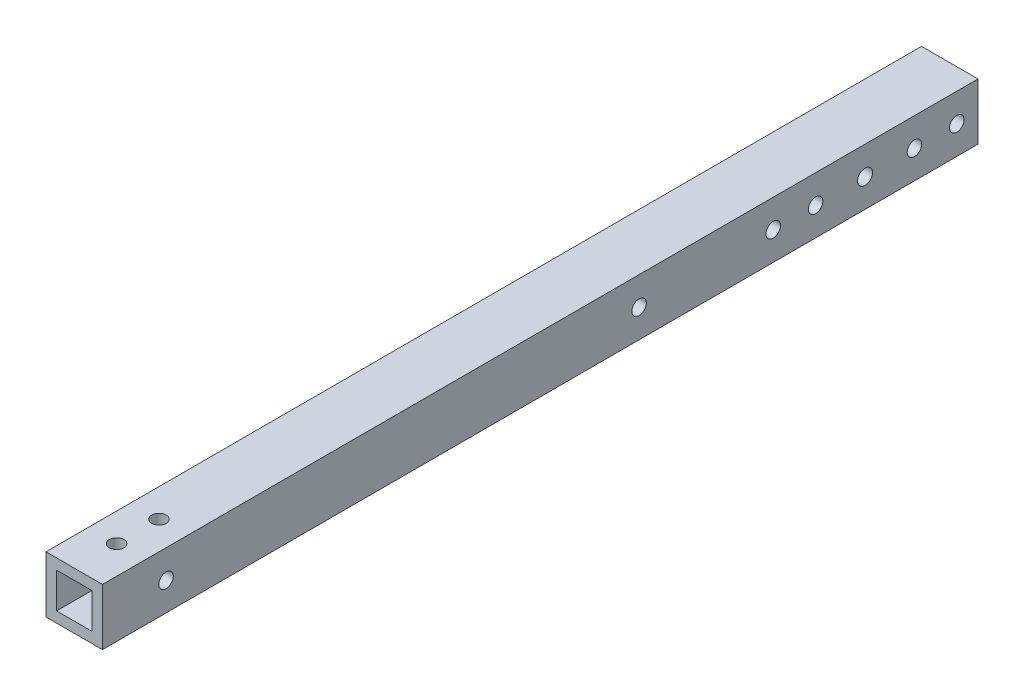
ISO-10303-21;
HEADER;
FILE_DESCRIPTION(('STEP AP214'),'2;1');
FILE_NAME('part.step','',(''),(''),'','','');
FILE_SCHEMA(('AUTOMOTIVE_DESIGN { 1 0 10303 214 1 1 1 1 }'));
ENDSEC;
DATA;
#1=APPLICATION_CONTEXT('core data for automotive mechanical design processes');
#2=APPLICATION_PROTOCOL_DEFINITION('international standard','automotive_design',2000,#1);
#3=PRODUCT_CONTEXT('',#1,'mechanical');
#4=PRODUCT('Part','Part','',(#3));
#5=PRODUCT_RELATED_PRODUCT_CATEGORY('part','',(#4));
#6=PRODUCT_DEFINITION_FORMATION('','',#4);
#7=PRODUCT_DEFINITION_CONTEXT('part definition',#1,'design');
#8=PRODUCT_DEFINITION('design','',#6,#7);
#9=PRODUCT_DEFINITION_SHAPE('','',#8);
#10=(LENGTH_UNIT() NAMED_UNIT(*) SI_UNIT(.MILLI.,.METRE.));
#11=(NAMED_UNIT(*) PLANE_ANGLE_UNIT() SI_UNIT($,.RADIAN.));
#12=(NAMED_UNIT(*) SI_UNIT($,.STERADIAN.) SOLID_ANGLE_UNIT());
#13=UNCERTAINTY_MEASURE_WITH_UNIT(LENGTH_MEASURE(1.E-05),#10,'distance_accuracy_value','');
#14=(GEOMETRIC_REPRESENTATION_CONTEXT(3) GLOBAL_UNCERTAINTY_ASSIGNED_CONTEXT((#13)) GLOBAL_UNIT_ASSIGNED_CONTEXT((#10,
#11,#12)) REPRESENTATION_CONTEXT('',''));
#15=CARTESIAN_POINT('',(0.,0.,0.));
#16=DIRECTION('',(0.,0.,1.));
#17=DIRECTION('',(1.,0.,0.));
#18=AXIS2_PLACEMENT_3D('',#15,#16,#17);
#19=CARTESIAN_POINT('',(0.,0.,196.85));
#20=DIRECTION('',(0.,0.,-1.));
#21=DIRECTION('',(-1.,0.,0.));
#22=AXIS2_PLACEMENT_3D('',#19,#20,#21);
#23=PLANE('',#22);
#24=DIRECTION('',(0.,1.,0.));
#25=VECTOR('',#24,1.);
#26=CARTESIAN_POINT('',(12.7,-12.7,196.85));
#27=LINE('',#26,#25);
#28=CARTESIAN_POINT('',(12.7,-12.7,196.85));
#29=VERTEX_POINT('',#28);
#30=CARTESIAN_POINT('',(12.7,12.7,196.85));
#31=VERTEX_POINT('',#30);
#32=EDGE_CURVE('E145',#29,#31,#27,.T.);
#33=ORIENTED_EDGE('',*,*,#32,.T.);
#34=DIRECTION('',(-1.,0.,0.));
#35=VECTOR('',#34,1.);
#36=CARTESIAN_POINT('',(-12.7,12.7,196.85));
#37=LINE('',#36,#35);
#38=CARTESIAN_POINT('',(-12.7,12.7,196.85));
#39=VERTEX_POINT('',#38);
#40=EDGE_CURVE('E148',#31,#39,#37,.T.);
#41=ORIENTED_EDGE('',*,*,#40,.T.);
#42=DIRECTION('',(0.,-1.,0.));
#43=VECTOR('',#42,1.);
#44=CARTESIAN_POINT('',(-12.7,-12.7,196.85));
#45=LINE('',#44,#43);
#46=CARTESIAN_POINT('',(-12.7,-12.7,196.85));
#47=VERTEX_POINT('',#46);
#48=EDGE_CURVE('E151',#39,#47,#45,.T.);
#49=ORIENTED_EDGE('',*,*,#48,.T.);
#50=DIRECTION('',(1.,0.,0.));
#51=VECTOR('',#50,1.);
#52=CARTESIAN_POINT('',(-12.7,-12.7,196.85));
#53=LINE('',#52,#51);
#54=EDGE_CURVE('E153',#47,#29,#53,.T.);
#55=ORIENTED_EDGE('',*,*,#54,.T.);
#56=EDGE_LOOP('',(#33,#41,#49,#55));
#57=FACE_BOUND('',#56,.T.);
#58=DIRECTION('',(0.,1.,0.));
#59=VECTOR('',#58,1.);
#60=CARTESIAN_POINT('',(7.9375,7.9375,196.85));
#61=LINE('',#60,#59);
#62=CARTESIAN_POINT('',(7.9375,-7.9375,196.85));
#63=VERTEX_POINT('',#62);
#64=CARTESIAN_POINT('',(7.9375,7.9375,196.85));
#65=VERTEX_POINT('',#64);
#66=EDGE_CURVE('E107',#63,#65,#61,.T.);
#67=ORIENTED_EDGE('',*,*,#66,.F.);
#68=DIRECTION('',(1.,0.,0.));
#69=VECTOR('',#68,1.);
#70=CARTESIAN_POINT('',(-7.9375,-7.9375,196.85));
#71=LINE('',#70,#69);
#72=CARTESIAN_POINT('',(-7.9375,-7.9375,196.85));
#73=VERTEX_POINT('',#72);
#74=EDGE_CURVE('E129',#73,#63,#71,.T.);
#75=ORIENTED_EDGE('',*,*,#74,.F.);
#76=DIRECTION('',(0.,-1.,0.));
#77=VECTOR('',#76,1.);
#78=CARTESIAN_POINT('',(-7.9375,7.9375,196.85));
#79=LINE('',#78,#77);
#80=CARTESIAN_POINT('',(-7.9375,7.9375,196.85));
#81=VERTEX_POINT('',#80);
#82=EDGE_CURVE('E127',#81,#73,#79,.T.);
#83=ORIENTED_EDGE('',*,*,#82,.F.);
#84=DIRECTION('',(-1.,0.,0.));
#85=VECTOR('',#84,1.);
#86=CARTESIAN_POINT('',(-7.9375,7.9375,196.85));
#87=LINE('',#86,#85);
#88=EDGE_CURVE('E115',#65,#81,#87,.T.);
#89=ORIENTED_EDGE('',*,*,#88,.F.);
#90=EDGE_LOOP('',(#67,#75,#83,#89));
#91=FACE_BOUND('',#90,.T.);
#92=ADVANCED_FACE('F40',(#57,#91),#23,.F.);
#93=CARTESIAN_POINT('',(0.,0.,-196.85));
#94=DIRECTION('',(0.,0.,-1.));
#95=DIRECTION('',(-1.,0.,0.));
#96=AXIS2_PLACEMENT_3D('',#93,#94,#95);
#97=PLANE('',#96);
#98=DIRECTION('',(0.,1.,0.));
#99=VECTOR('',#98,1.);
#100=CARTESIAN_POINT('',(12.7,-12.7,-196.85));
#101=LINE('',#100,#99);
#102=CARTESIAN_POINT('',(12.7,-12.7,-196.85));
#103=VERTEX_POINT('',#102);
#104=CARTESIAN_POINT('',(12.7,12.7,-196.85));
#105=VERTEX_POINT('',#104);
#106=EDGE_CURVE('E123',#103,#105,#101,.T.);
#107=ORIENTED_EDGE('',*,*,#106,.F.);
#108=DIRECTION('',(1.,0.,0.));
#109=VECTOR('',#108,1.);
#110=CARTESIAN_POINT('',(-12.7,-12.7,-196.85));
#111=LINE('',#110,#109);
#112=CARTESIAN_POINT('',(-12.7,-12.7,-196.85));
#113=VERTEX_POINT('',#112);
#114=EDGE_CURVE('E149',#113,#103,#111,.T.);
#115=ORIENTED_EDGE('',*,*,#114,.F.);
#116=DIRECTION('',(0.,-1.,0.));
#117=VECTOR('',#116,1.);
#118=CARTESIAN_POINT('',(-12.7,-12.7,-196.85));
#119=LINE('',#118,#117);
#120=CARTESIAN_POINT('',(-12.7,12.7,-196.85));
#121=VERTEX_POINT('',#120);
#122=EDGE_CURVE('E160',#121,#113,#119,.T.);
#123=ORIENTED_EDGE('',*,*,#122,.F.);
#124=DIRECTION('',(-1.,0.,0.));
#125=VECTOR('',#124,1.);
#126=CARTESIAN_POINT('',(-12.7,12.7,-196.85));
#127=LINE('',#126,#125);
#128=EDGE_CURVE('E158',#105,#121,#127,.T.);
#129=ORIENTED_EDGE('',*,*,#128,.F.);
#130=EDGE_LOOP('',(#107,#115,#123,#129));
#131=FACE_BOUND('',#130,.T.);
#132=DIRECTION('',(1.,0.,0.));
#133=VECTOR('',#132,1.);
#134=CARTESIAN_POINT('',(-7.9375,-7.9375,-196.85));
#135=LINE('',#134,#133);
#136=CARTESIAN_POINT('',(-7.9375,-7.9375,-196.85));
#137=VERTEX_POINT('',#136);
#138=CARTESIAN_POINT('',(7.9375,-7.9375,-196.85));
#139=VERTEX_POINT('',#138);
#140=EDGE_CURVE('E116',#137,#139,#135,.T.);
#141=ORIENTED_EDGE('',*,*,#140,.T.);
#142=DIRECTION('',(0.,1.,0.));
#143=VECTOR('',#142,1.);
#144=CARTESIAN_POINT('',(7.9375,7.9375,-196.85));
#145=LINE('',#144,#143);
#146=CARTESIAN_POINT('',(7.9375,7.9375,-196.85));
#147=VERTEX_POINT('',#146);
#148=EDGE_CURVE('E65',#139,#147,#145,.T.);
#149=ORIENTED_EDGE('',*,*,#148,.T.);
#150=DIRECTION('',(-1.,0.,0.));
#151=VECTOR('',#150,1.);
#152=CARTESIAN_POINT('',(-7.9375,7.9375,-196.85));
#153=LINE('',#152,#151);
#154=CARTESIAN_POINT('',(-7.9375,7.9375,-196.85));
#155=VERTEX_POINT('',#154);
#156=EDGE_CURVE('E122',#147,#155,#153,.T.);
#157=ORIENTED_EDGE('',*,*,#156,.T.);
#158=DIRECTION('',(0.,-1.,0.));
#159=VECTOR('',#158,1.);
#160=CARTESIAN_POINT('',(-7.9375,7.9375,-196.85));
#161=LINE('',#160,#159);
#162=EDGE_CURVE('E137',#155,#137,#161,.T.);
#163=ORIENTED_EDGE('',*,*,#162,.T.);
#164=EDGE_LOOP('',(#141,#149,#157,#163));
#165=FACE_BOUND('',#164,.T.);
#166=ADVANCED_FACE('F279',(#131,#165),#97,.T.);
#167=CARTESIAN_POINT('',(12.7,-12.7,196.85));
#168=DIRECTION('',(-1.,0.,0.));
#169=DIRECTION('',(0.,0.,1.));
#170=AXIS2_PLACEMENT_3D('',#167,#168,#169);
#171=PLANE('',#170);
#172=CARTESIAN_POINT('',(12.7,0.,-146.05));
#173=DIRECTION('',(-1.,0.,0.));
#174=DIRECTION('',(0.,0.,1.));
#175=AXIS2_PLACEMENT_3D('',#172,#173,#174);
#176=CIRCLE('',#175,3.373501);
#177=CARTESIAN_POINT('',(12.7,0.,-142.676499));
#178=VERTEX_POINT('',#177);
#179=EDGE_CURVE('E379',#178,#178,#176,.T.);
#180=ORIENTED_EDGE('',*,*,#179,.T.);
#181=EDGE_LOOP('',(#180));
#182=FACE_BOUND('',#181,.T.);
#183=CARTESIAN_POINT('',(12.7,0.,168.275));
#184=DIRECTION('',(-1.,0.,0.));
#185=DIRECTION('',(0.,0.,1.));
#186=AXIS2_PLACEMENT_3D('',#183,#184,#185);
#187=CIRCLE('',#186,3.2639);
#188=CARTESIAN_POINT('',(12.7,0.,171.5389));
#189=VERTEX_POINT('',#188);
#190=EDGE_CURVE('E390',#189,#189,#187,.T.);
#191=ORIENTED_EDGE('',*,*,#190,.T.);
#192=EDGE_LOOP('',(#191));
#193=FACE_BOUND('',#192,.T.);
#194=CARTESIAN_POINT('',(12.7,0.,-44.45));
#195=DIRECTION('',(-1.,0.,0.));
#196=DIRECTION('',(0.,0.,1.));
#197=AXIS2_PLACEMENT_3D('',#194,#195,#196);
#198=CIRCLE('',#197,3.2639);
#199=CARTESIAN_POINT('',(12.7,0.,-41.1861));
#200=VERTEX_POINT('',#199);
#201=EDGE_CURVE('E192',#200,#200,#198,.T.);
#202=ORIENTED_EDGE('',*,*,#201,.T.);
#203=EDGE_LOOP('',(#202));
#204=FACE_BOUND('',#203,.T.);
#205=CARTESIAN_POINT('',(12.7,0.,-104.775));
#206=DIRECTION('',(-1.,0.,0.));
#207=DIRECTION('',(0.,0.,1.));
#208=AXIS2_PLACEMENT_3D('',#205,#206,#207);
#209=CIRCLE('',#208,3.2639);
#210=CARTESIAN_POINT('',(12.7,0.,-101.5111));
#211=VERTEX_POINT('',#210);
#212=EDGE_CURVE('E179',#211,#211,#209,.T.);
#213=ORIENTED_EDGE('',*,*,#212,.T.);
#214=EDGE_LOOP('',(#213));
#215=FACE_BOUND('',#214,.T.);
#216=CARTESIAN_POINT('',(12.7,0.,-123.825));
#217=DIRECTION('',(-1.,0.,0.));
#218=DIRECTION('',(0.,0.,1.));
#219=AXIS2_PLACEMENT_3D('',#216,#217,#218);
#220=CIRCLE('',#219,3.2639);
#221=CARTESIAN_POINT('',(12.7,0.,-120.5611));
#222=VERTEX_POINT('',#221);
#223=EDGE_CURVE('E174',#222,#222,#220,.T.);
#224=ORIENTED_EDGE('',*,*,#223,.T.);
#225=EDGE_LOOP('',(#224));
#226=FACE_BOUND('',#225,.T.);
#227=CARTESIAN_POINT('',(12.7,0.,-168.275));
#228=DIRECTION('',(-1.,0.,0.));
#229=DIRECTION('',(0.,0.,1.));
#230=AXIS2_PLACEMENT_3D('',#227,#228,#229);
#231=CIRCLE('',#230,3.2639);
#232=CARTESIAN_POINT('',(12.7,0.,-165.0111));
#233=VERTEX_POINT('',#232);
#234=EDGE_CURVE('E238',#233,#233,#231,.T.);
#235=ORIENTED_EDGE('',*,*,#234,.T.);
#236=EDGE_LOOP('',(#235));
#237=FACE_BOUND('',#236,.T.);
#238=CARTESIAN_POINT('',(12.7,0.,-187.325));
#239=DIRECTION('',(-1.,0.,0.));
#240=DIRECTION('',(0.,0.,1.));
#241=AXIS2_PLACEMENT_3D('',#238,#239,#240);
#242=CIRCLE('',#241,3.2639);
#243=CARTESIAN_POINT('',(12.7,0.,-184.0611));
#244=VERTEX_POINT('',#243);
#245=EDGE_CURVE('E250',#244,#244,#242,.T.);
#246=ORIENTED_EDGE('',*,*,#245,.T.);
#247=EDGE_LOOP('',(#246));
#248=FACE_BOUND('',#247,.T.);
#249=ORIENTED_EDGE('',*,*,#106,.T.);
#250=DIRECTION('',(0.,0.,-1.));
#251=VECTOR('',#250,1.);
#252=CARTESIAN_POINT('',(12.7,12.7,196.85));
#253=LINE('',#252,#251);
#254=EDGE_CURVE('E11',#31,#105,#253,.T.);
#255=ORIENTED_EDGE('',*,*,#254,.F.);
#256=ORIENTED_EDGE('',*,*,#32,.F.);
#257=DIRECTION('',(0.,0.,-1.));
#258=VECTOR('',#257,1.);
#259=CARTESIAN_POINT('',(12.7,-12.7,196.85));
#260=LINE('',#259,#258);
#261=EDGE_CURVE('E155',#29,#103,#260,.T.);
#262=ORIENTED_EDGE('',*,*,#261,.T.);
#263=EDGE_LOOP('',(#249,#255,#256,#262));
#264=FACE_BOUND('',#263,.T.);
#265=ADVANCED_FACE('F42',(#182,#193,#204,#215,#226,#237,#248,#264),#171,.F.);
#266=CARTESIAN_POINT('',(-12.7,12.7,196.85));
#267=DIRECTION('',(0.,-1.,0.));
#268=DIRECTION('',(0.,0.,-1.));
#269=AXIS2_PLACEMENT_3D('',#266,#267,#268);
#270=PLANE('',#269);
#271=CARTESIAN_POINT('',(0.,12.7,177.8));
#272=DIRECTION('',(0.,1.,0.));
#273=DIRECTION('',(0.,0.,1.));
#274=AXIS2_PLACEMENT_3D('',#271,#272,#273);
#275=CIRCLE('',#274,3.26389999999999);
#276=CARTESIAN_POINT('',(0.,12.7,181.0639));
#277=VERTEX_POINT('',#276);
#278=EDGE_CURVE('E196',#277,#277,#275,.T.);
#279=ORIENTED_EDGE('',*,*,#278,.F.);
#280=EDGE_LOOP('',(#279));
#281=FACE_BOUND('',#280,.T.);
#282=CARTESIAN_POINT('',(0.,12.7,158.75));
#283=DIRECTION('',(0.,1.,0.));
#284=DIRECTION('',(0.,0.,1.));
#285=AXIS2_PLACEMENT_3D('',#282,#283,#284);
#286=CIRCLE('',#285,3.26389999999999);
#287=CARTESIAN_POINT('',(0.,12.7,162.0139));
#288=VERTEX_POINT('',#287);
#289=EDGE_CURVE('E214',#288,#288,#286,.T.);
#290=ORIENTED_EDGE('',*,*,#289,.F.);
#291=EDGE_LOOP('',(#290));
#292=FACE_BOUND('',#291,.T.);
#293=ORIENTED_EDGE('',*,*,#128,.T.);
#294=DIRECTION('',(0.,0.,-1.));
#295=VECTOR('',#294,1.);
#296=CARTESIAN_POINT('',(-12.7,12.7,196.85));
#297=LINE('',#296,#295);
#298=EDGE_CURVE('E49',#39,#121,#297,.T.);
#299=ORIENTED_EDGE('',*,*,#298,.F.);
#300=ORIENTED_EDGE('',*,*,#40,.F.);
#301=ORIENTED_EDGE('',*,*,#254,.T.);
#302=EDGE_LOOP('',(#293,#299,#300,#301));
#303=FACE_BOUND('',#302,.T.);
#304=ADVANCED_FACE('F288',(#281,#292,#303),#270,.F.);
#305=CARTESIAN_POINT('',(-12.7,-12.7,196.85));
#306=DIRECTION('',(1.,0.,0.));
#307=DIRECTION('',(0.,0.,-1.));
#308=AXIS2_PLACEMENT_3D('',#305,#306,#307);
#309=PLANE('',#308);
#310=CARTESIAN_POINT('',(-12.7,0.,-146.05));
#311=DIRECTION('',(-1.,0.,0.));
#312=DIRECTION('',(0.,0.,1.));
#313=AXIS2_PLACEMENT_3D('',#310,#311,#312);
#314=CIRCLE('',#313,3.373501);
#315=CARTESIAN_POINT('',(-12.7,0.,-142.676499));
#316=VERTEX_POINT('',#315);
#317=EDGE_CURVE('E378',#316,#316,#314,.T.);
#318=ORIENTED_EDGE('',*,*,#317,.F.);
#319=EDGE_LOOP('',(#318));
#320=FACE_BOUND('',#319,.T.);
#321=CARTESIAN_POINT('',(-12.7,0.,168.275));
#322=DIRECTION('',(-1.,0.,0.));
#323=DIRECTION('',(0.,0.,1.));
#324=AXIS2_PLACEMENT_3D('',#321,#322,#323);
#325=CIRCLE('',#324,3.26389999999999);
#326=CARTESIAN_POINT('',(-12.7,0.,171.5389));
#327=VERTEX_POINT('',#326);
#328=EDGE_CURVE('E387',#327,#327,#325,.T.);
#329=ORIENTED_EDGE('',*,*,#328,.F.);
#330=EDGE_LOOP('',(#329));
#331=FACE_BOUND('',#330,.T.);
#332=CARTESIAN_POINT('',(-12.7,0.,-44.45));
#333=DIRECTION('',(-1.,0.,0.));
#334=DIRECTION('',(0.,0.,1.));
#335=AXIS2_PLACEMENT_3D('',#332,#333,#334);
#336=CIRCLE('',#335,3.26389999999999);
#337=CARTESIAN_POINT('',(-12.7,0.,-41.1861));
#338=VERTEX_POINT('',#337);
#339=EDGE_CURVE('E199',#338,#338,#336,.T.);
#340=ORIENTED_EDGE('',*,*,#339,.F.);
#341=EDGE_LOOP('',(#340));
#342=FACE_BOUND('',#341,.T.);
#343=CARTESIAN_POINT('',(-12.7,0.,-104.775));
#344=DIRECTION('',(-1.,0.,0.));
#345=DIRECTION('',(0.,0.,1.));
#346=AXIS2_PLACEMENT_3D('',#343,#344,#345);
#347=CIRCLE('',#346,3.26389999999999);
#348=CARTESIAN_POINT('',(-12.7,0.,-101.5111));
#349=VERTEX_POINT('',#348);
#350=EDGE_CURVE('E221',#349,#349,#347,.T.);
#351=ORIENTED_EDGE('',*,*,#350,.F.);
#352=EDGE_LOOP('',(#351));
#353=FACE_BOUND('',#352,.T.);
#354=CARTESIAN_POINT('',(-12.7,0.,-123.825));
#355=DIRECTION('',(-1.,0.,0.));
#356=DIRECTION('',(0.,0.,1.));
#357=AXIS2_PLACEMENT_3D('',#354,#355,#356);
#358=CIRCLE('',#357,3.26389999999999);
#359=CARTESIAN_POINT('',(-12.7,0.,-120.5611));
#360=VERTEX_POINT('',#359);
#361=EDGE_CURVE('E228',#360,#360,#358,.T.);
#362=ORIENTED_EDGE('',*,*,#361,.F.);
#363=EDGE_LOOP('',(#362));
#364=FACE_BOUND('',#363,.T.);
#365=CARTESIAN_POINT('',(-12.7,0.,-168.275));
#366=DIRECTION('',(-1.,0.,0.));
#367=DIRECTION('',(0.,0.,1.));
#368=AXIS2_PLACEMENT_3D('',#365,#366,#367);
#369=CIRCLE('',#368,3.26389999999999);
#370=CARTESIAN_POINT('',(-12.7,0.,-165.0111));
#371=VERTEX_POINT('',#370);
#372=EDGE_CURVE('E235',#371,#371,#369,.T.);
#373=ORIENTED_EDGE('',*,*,#372,.F.);
#374=EDGE_LOOP('',(#373));
#375=FACE_BOUND('',#374,.T.);
#376=CARTESIAN_POINT('',(-12.7,0.,-187.325));
#377=DIRECTION('',(-1.,0.,0.));
#378=DIRECTION('',(0.,0.,1.));
#379=AXIS2_PLACEMENT_3D('',#376,#377,#378);
#380=CIRCLE('',#379,3.26389999999999);
#381=CARTESIAN_POINT('',(-12.7,0.,-184.0611));
#382=VERTEX_POINT('',#381);
#383=EDGE_CURVE('E247',#382,#382,#380,.T.);
#384=ORIENTED_EDGE('',*,*,#383,.F.);
#385=EDGE_LOOP('',(#384));
#386=FACE_BOUND('',#385,.T.);
#387=ORIENTED_EDGE('',*,*,#122,.T.);
#388=DIRECTION('',(0.,0.,-1.));
#389=VECTOR('',#388,1.);
#390=CARTESIAN_POINT('',(-12.7,-12.7,196.85));
#391=LINE('',#390,#389);
#392=EDGE_CURVE('E165',#47,#113,#391,.T.);
#393=ORIENTED_EDGE('',*,*,#392,.F.);
#394=ORIENTED_EDGE('',*,*,#48,.F.);
#395=ORIENTED_EDGE('',*,*,#298,.T.);
#396=EDGE_LOOP('',(#387,#393,#394,#395));
#397=FACE_BOUND('',#396,.T.);
#398=ADVANCED_FACE('F272',(#320,#331,#342,#353,#364,#375,#386,#397),#309,.F.);
#399=CARTESIAN_POINT('',(-12.7,-12.7,196.85));
#400=DIRECTION('',(0.,1.,0.));
#401=DIRECTION('',(0.,0.,1.));
#402=AXIS2_PLACEMENT_3D('',#399,#400,#401);
#403=PLANE('',#402);
#404=CARTESIAN_POINT('',(0.,-12.7,177.8));
#405=DIRECTION('',(0.,1.,0.));
#406=DIRECTION('',(0.,0.,1.));
#407=AXIS2_PLACEMENT_3D('',#404,#405,#406);
#408=CIRCLE('',#407,3.2639);
#409=CARTESIAN_POINT('',(0.,-12.7,181.0639));
#410=VERTEX_POINT('',#409);
#411=EDGE_CURVE('E188',#410,#410,#408,.T.);
#412=ORIENTED_EDGE('',*,*,#411,.T.);
#413=EDGE_LOOP('',(#412));
#414=FACE_BOUND('',#413,.T.);
#415=CARTESIAN_POINT('',(0.,-12.7,158.75));
#416=DIRECTION('',(0.,1.,0.));
#417=DIRECTION('',(0.,0.,1.));
#418=AXIS2_PLACEMENT_3D('',#415,#416,#417);
#419=CIRCLE('',#418,3.2639);
#420=CARTESIAN_POINT('',(0.,-12.7,162.0139));
#421=VERTEX_POINT('',#420);
#422=EDGE_CURVE('E184',#421,#421,#419,.T.);
#423=ORIENTED_EDGE('',*,*,#422,.T.);
#424=EDGE_LOOP('',(#423));
#425=FACE_BOUND('',#424,.T.);
#426=ORIENTED_EDGE('',*,*,#114,.T.);
#427=ORIENTED_EDGE('',*,*,#261,.F.);
#428=ORIENTED_EDGE('',*,*,#54,.F.);
#429=ORIENTED_EDGE('',*,*,#392,.T.);
#430=EDGE_LOOP('',(#426,#427,#428,#429));
#431=FACE_BOUND('',#430,.T.);
#432=ADVANCED_FACE('F262',(#414,#425,#431),#403,.F.);
#433=CARTESIAN_POINT('',(7.9375,7.9375,196.85));
#434=DIRECTION('',(-1.,0.,0.));
#435=DIRECTION('',(0.,-1.,0.));
#436=AXIS2_PLACEMENT_3D('',#433,#434,#435);
#437=PLANE('',#436);
#438=CARTESIAN_POINT('',(7.93749999999999,0.,-146.05));
#439=DIRECTION('',(-1.,0.,0.));
#440=DIRECTION('',(0.,-1.,0.));
#441=AXIS2_PLACEMENT_3D('',#438,#439,#440);
#442=CIRCLE('',#441,3.373501);
#443=CARTESIAN_POINT('',(7.93749999999999,-3.373501,-146.05));
#444=VERTEX_POINT('',#443);
#445=EDGE_CURVE('E384',#444,#444,#442,.T.);
#446=ORIENTED_EDGE('',*,*,#445,.F.);
#447=EDGE_LOOP('',(#446));
#448=FACE_BOUND('',#447,.T.);
#449=CARTESIAN_POINT('',(7.93749999999999,0.,168.275));
#450=DIRECTION('',(-1.,0.,0.));
#451=DIRECTION('',(0.,-1.,0.));
#452=AXIS2_PLACEMENT_3D('',#449,#450,#451);
#453=CIRCLE('',#452,3.26389999999999);
#454=CARTESIAN_POINT('',(7.93749999999999,-3.26389999999999,168.275));
#455=VERTEX_POINT('',#454);
#456=EDGE_CURVE('E393',#455,#455,#453,.T.);
#457=ORIENTED_EDGE('',*,*,#456,.F.);
#458=EDGE_LOOP('',(#457));
#459=FACE_BOUND('',#458,.T.);
#460=CARTESIAN_POINT('',(7.93749999999999,0.,-44.45));
#461=DIRECTION('',(-1.,0.,0.));
#462=DIRECTION('',(0.,-1.,0.));
#463=AXIS2_PLACEMENT_3D('',#460,#461,#462);
#464=CIRCLE('',#463,3.26389999999999);
#465=CARTESIAN_POINT('',(7.93749999999999,-3.26389999999999,-44.45));
#466=VERTEX_POINT('',#465);
#467=EDGE_CURVE('E191',#466,#466,#464,.T.);
#468=ORIENTED_EDGE('',*,*,#467,.F.);
#469=EDGE_LOOP('',(#468));
#470=FACE_BOUND('',#469,.T.);
#471=CARTESIAN_POINT('',(7.93749999999999,0.,-104.775));
#472=DIRECTION('',(-1.,0.,0.));
#473=DIRECTION('',(0.,-1.,0.));
#474=AXIS2_PLACEMENT_3D('',#471,#472,#473);
#475=CIRCLE('',#474,3.26389999999999);
#476=CARTESIAN_POINT('',(7.93749999999999,-3.26389999999999,-104.775));
#477=VERTEX_POINT('',#476);
#478=EDGE_CURVE('E178',#477,#477,#475,.T.);
#479=ORIENTED_EDGE('',*,*,#478,.F.);
#480=EDGE_LOOP('',(#479));
#481=FACE_BOUND('',#480,.T.);
#482=CARTESIAN_POINT('',(7.93749999999999,0.,-123.825));
#483=DIRECTION('',(-1.,0.,0.));
#484=DIRECTION('',(0.,-1.,0.));
#485=AXIS2_PLACEMENT_3D('',#482,#483,#484);
#486=CIRCLE('',#485,3.26389999999999);
#487=CARTESIAN_POINT('',(7.93749999999999,-3.26389999999999,-123.825));
#488=VERTEX_POINT('',#487);
#489=EDGE_CURVE('E173',#488,#488,#486,.T.);
#490=ORIENTED_EDGE('',*,*,#489,.F.);
#491=EDGE_LOOP('',(#490));
#492=FACE_BOUND('',#491,.T.);
#493=CARTESIAN_POINT('',(7.93749999999999,0.,-168.275));
#494=DIRECTION('',(-1.,0.,0.));
#495=DIRECTION('',(0.,-1.,0.));
#496=AXIS2_PLACEMENT_3D('',#493,#494,#495);
#497=CIRCLE('',#496,3.26389999999999);
#498=CARTESIAN_POINT('',(7.93749999999999,-3.26389999999999,-168.275));
#499=VERTEX_POINT('',#498);
#500=EDGE_CURVE('E241',#499,#499,#497,.T.);
#501=ORIENTED_EDGE('',*,*,#500,.F.);
#502=EDGE_LOOP('',(#501));
#503=FACE_BOUND('',#502,.T.);
#504=CARTESIAN_POINT('',(7.93749999999999,0.,-187.325));
#505=DIRECTION('',(-1.,0.,0.));
#506=DIRECTION('',(0.,-1.,0.));
#507=AXIS2_PLACEMENT_3D('',#504,#505,#506);
#508=CIRCLE('',#507,3.26389999999999);
#509=CARTESIAN_POINT('',(7.93749999999999,-3.26389999999999,-187.325));
#510=VERTEX_POINT('',#509);
#511=EDGE_CURVE('E135',#510,#510,#508,.T.);
#512=ORIENTED_EDGE('',*,*,#511,.F.);
#513=EDGE_LOOP('',(#512));
#514=FACE_BOUND('',#513,.T.);
#515=ORIENTED_EDGE('',*,*,#148,.F.);
#516=DIRECTION('',(0.,0.,-1.));
#517=VECTOR('',#516,1.);
#518=CARTESIAN_POINT('',(7.9375,-7.9375,196.85));
#519=LINE('',#518,#517);
#520=EDGE_CURVE('E111',#63,#139,#519,.T.);
#521=ORIENTED_EDGE('',*,*,#520,.F.);
#522=ORIENTED_EDGE('',*,*,#66,.T.);
#523=DIRECTION('',(0.,0.,-1.));
#524=VECTOR('',#523,1.);
#525=CARTESIAN_POINT('',(7.9375,7.9375,196.85));
#526=LINE('',#525,#524);
#527=EDGE_CURVE('E110',#65,#147,#526,.T.);
#528=ORIENTED_EDGE('',*,*,#527,.T.);
#529=EDGE_LOOP('',(#515,#521,#522,#528));
#530=FACE_BOUND('',#529,.T.);
#531=ADVANCED_FACE('F109',(#448,#459,#470,#481,#492,#503,#514,#530),#437,.T.);
#532=CARTESIAN_POINT('',(-7.9375,7.9375,196.85));
#533=DIRECTION('',(0.,-1.,0.));
#534=DIRECTION('',(1.,0.,0.));
#535=AXIS2_PLACEMENT_3D('',#532,#533,#534);
#536=PLANE('',#535);
#537=CARTESIAN_POINT('',(0.,7.9375,177.8));
#538=DIRECTION('',(0.,-1.,0.));
#539=DIRECTION('',(1.,0.,0.));
#540=AXIS2_PLACEMENT_3D('',#537,#538,#539);
#541=CIRCLE('',#540,3.26389999999999);
#542=CARTESIAN_POINT('',(3.26389999999999,7.9375,177.8));
#543=VERTEX_POINT('',#542);
#544=EDGE_CURVE('E187',#543,#543,#541,.T.);
#545=ORIENTED_EDGE('',*,*,#544,.F.);
#546=EDGE_LOOP('',(#545));
#547=FACE_BOUND('',#546,.T.);
#548=CARTESIAN_POINT('',(0.,7.9375,158.75));
#549=DIRECTION('',(0.,-1.,0.));
#550=DIRECTION('',(1.,0.,0.));
#551=AXIS2_PLACEMENT_3D('',#548,#549,#550);
#552=CIRCLE('',#551,3.26389999999999);
#553=CARTESIAN_POINT('',(3.26389999999999,7.9375,158.75));
#554=VERTEX_POINT('',#553);
#555=EDGE_CURVE('E183',#554,#554,#552,.T.);
#556=ORIENTED_EDGE('',*,*,#555,.F.);
#557=EDGE_LOOP('',(#556));
#558=FACE_BOUND('',#557,.T.);
#559=ORIENTED_EDGE('',*,*,#156,.F.);
#560=ORIENTED_EDGE('',*,*,#527,.F.);
#561=ORIENTED_EDGE('',*,*,#88,.T.);
#562=DIRECTION('',(0.,0.,-1.));
#563=VECTOR('',#562,1.);
#564=CARTESIAN_POINT('',(-7.9375,7.9375,196.85));
#565=LINE('',#564,#563);
#566=EDGE_CURVE('E124',#81,#155,#565,.T.);
#567=ORIENTED_EDGE('',*,*,#566,.T.);
#568=EDGE_LOOP('',(#559,#560,#561,#567));
#569=FACE_BOUND('',#568,.T.);
#570=ADVANCED_FACE('F119',(#547,#558,#569),#536,.T.);
#571=CARTESIAN_POINT('',(-7.9375,7.9375,196.85));
#572=DIRECTION('',(1.,0.,0.));
#573=DIRECTION('',(0.,0.,-1.));
#574=AXIS2_PLACEMENT_3D('',#571,#572,#573);
#575=PLANE('',#574);
#576=CARTESIAN_POINT('',(-7.9375,0.,-146.05));
#577=DIRECTION('',(1.,0.,0.));
#578=DIRECTION('',(0.,0.,-1.));
#579=AXIS2_PLACEMENT_3D('',#576,#577,#578);
#580=CIRCLE('',#579,3.373501);
#581=CARTESIAN_POINT('',(-7.9375,0.,-149.423501));
#582=VERTEX_POINT('',#581);
#583=EDGE_CURVE('E44',#582,#582,#580,.T.);
#584=ORIENTED_EDGE('',*,*,#583,.F.);
#585=EDGE_LOOP('',(#584));
#586=FACE_BOUND('',#585,.T.);
#587=CARTESIAN_POINT('',(-7.9375,0.,168.275));
#588=DIRECTION('',(1.,0.,0.));
#589=DIRECTION('',(0.,0.,-1.));
#590=AXIS2_PLACEMENT_3D('',#587,#588,#589);
#591=CIRCLE('',#590,3.26389999999999);
#592=CARTESIAN_POINT('',(-7.9375,0.,165.0111));
#593=VERTEX_POINT('',#592);
#594=EDGE_CURVE('E204',#593,#593,#591,.T.);
#595=ORIENTED_EDGE('',*,*,#594,.F.);
#596=EDGE_LOOP('',(#595));
#597=FACE_BOUND('',#596,.T.);
#598=CARTESIAN_POINT('',(-7.9375,0.,-44.45));
#599=DIRECTION('',(1.,0.,0.));
#600=DIRECTION('',(0.,0.,-1.));
#601=AXIS2_PLACEMENT_3D('',#598,#599,#600);
#602=CIRCLE('',#601,3.26389999999999);
#603=CARTESIAN_POINT('',(-7.9375,0.,-47.7139));
#604=VERTEX_POINT('',#603);
#605=EDGE_CURVE('E189',#604,#604,#602,.T.);
#606=ORIENTED_EDGE('',*,*,#605,.F.);
#607=EDGE_LOOP('',(#606));
#608=FACE_BOUND('',#607,.T.);
#609=CARTESIAN_POINT('',(-7.9375,0.,-104.775));
#610=DIRECTION('',(1.,0.,0.));
#611=DIRECTION('',(0.,0.,-1.));
#612=AXIS2_PLACEMENT_3D('',#609,#610,#611);
#613=CIRCLE('',#612,3.26389999999999);
#614=CARTESIAN_POINT('',(-7.9375,0.,-108.0389));
#615=VERTEX_POINT('',#614);
#616=EDGE_CURVE('E175',#615,#615,#613,.T.);
#617=ORIENTED_EDGE('',*,*,#616,.F.);
#618=EDGE_LOOP('',(#617));
#619=FACE_BOUND('',#618,.T.);
#620=CARTESIAN_POINT('',(-7.9375,0.,-123.825));
#621=DIRECTION('',(1.,0.,0.));
#622=DIRECTION('',(0.,0.,-1.));
#623=AXIS2_PLACEMENT_3D('',#620,#621,#622);
#624=CIRCLE('',#623,3.26389999999999);
#625=CARTESIAN_POINT('',(-7.9375,0.,-127.0889));
#626=VERTEX_POINT('',#625);
#627=EDGE_CURVE('E170',#626,#626,#624,.T.);
#628=ORIENTED_EDGE('',*,*,#627,.F.);
#629=EDGE_LOOP('',(#628));
#630=FACE_BOUND('',#629,.T.);
#631=CARTESIAN_POINT('',(-7.9375,0.,-168.275));
#632=DIRECTION('',(1.,0.,0.));
#633=DIRECTION('',(0.,0.,-1.));
#634=AXIS2_PLACEMENT_3D('',#631,#632,#633);
#635=CIRCLE('',#634,3.26389999999999);
#636=CARTESIAN_POINT('',(-7.9375,0.,-171.5389));
#637=VERTEX_POINT('',#636);
#638=EDGE_CURVE('E244',#637,#637,#635,.T.);
#639=ORIENTED_EDGE('',*,*,#638,.F.);
#640=EDGE_LOOP('',(#639));
#641=FACE_BOUND('',#640,.T.);
#642=CARTESIAN_POINT('',(-7.9375,0.,-187.325));
#643=DIRECTION('',(1.,0.,0.));
#644=DIRECTION('',(0.,0.,-1.));
#645=AXIS2_PLACEMENT_3D('',#642,#643,#644);
#646=CIRCLE('',#645,3.26389999999999);
#647=CARTESIAN_POINT('',(-7.9375,0.,-190.5889));
#648=VERTEX_POINT('',#647);
#649=EDGE_CURVE('E253',#648,#648,#646,.T.);
#650=ORIENTED_EDGE('',*,*,#649,.F.);
#651=EDGE_LOOP('',(#650));
#652=FACE_BOUND('',#651,.T.);
#653=ORIENTED_EDGE('',*,*,#162,.F.);
#654=ORIENTED_EDGE('',*,*,#566,.F.);
#655=ORIENTED_EDGE('',*,*,#82,.T.);
#656=DIRECTION('',(0.,0.,-1.));
#657=VECTOR('',#656,1.);
#658=CARTESIAN_POINT('',(-7.9375,-7.9375,196.85));
#659=LINE('',#658,#657);
#660=EDGE_CURVE('E57',#73,#137,#659,.T.);
#661=ORIENTED_EDGE('',*,*,#660,.T.);
#662=EDGE_LOOP('',(#653,#654,#655,#661));
#663=FACE_BOUND('',#662,.T.);
#664=ADVANCED_FACE('F269',(#586,#597,#608,#619,#630,#641,#652,#663),#575,.T.);
#665=CARTESIAN_POINT('',(-7.9375,-7.9375,196.85));
#666=DIRECTION('',(0.,1.,0.));
#667=DIRECTION('',(-1.,0.,0.));
#668=AXIS2_PLACEMENT_3D('',#665,#666,#667);
#669=PLANE('',#668);
#670=CARTESIAN_POINT('',(0.,-7.9375,177.8));
#671=DIRECTION('',(0.,1.,0.));
#672=DIRECTION('',(-1.,0.,0.));
#673=AXIS2_PLACEMENT_3D('',#670,#671,#672);
#674=CIRCLE('',#673,3.26389999999999);
#675=CARTESIAN_POINT('',(-3.26389999999999,-7.9375,177.8));
#676=VERTEX_POINT('',#675);
#677=EDGE_CURVE('E185',#676,#676,#674,.T.);
#678=ORIENTED_EDGE('',*,*,#677,.F.);
#679=EDGE_LOOP('',(#678));
#680=FACE_BOUND('',#679,.T.);
#681=CARTESIAN_POINT('',(0.,-7.9375,158.75));
#682=DIRECTION('',(0.,1.,0.));
#683=DIRECTION('',(-1.,0.,0.));
#684=AXIS2_PLACEMENT_3D('',#681,#682,#683);
#685=CIRCLE('',#684,3.26389999999999);
#686=CARTESIAN_POINT('',(-3.26389999999999,-7.9375,158.75));
#687=VERTEX_POINT('',#686);
#688=EDGE_CURVE('E180',#687,#687,#685,.T.);
#689=ORIENTED_EDGE('',*,*,#688,.F.);
#690=EDGE_LOOP('',(#689));
#691=FACE_BOUND('',#690,.T.);
#692=ORIENTED_EDGE('',*,*,#140,.F.);
#693=ORIENTED_EDGE('',*,*,#660,.F.);
#694=ORIENTED_EDGE('',*,*,#74,.T.);
#695=ORIENTED_EDGE('',*,*,#520,.T.);
#696=EDGE_LOOP('',(#692,#693,#694,#695));
#697=FACE_BOUND('',#696,.T.);
#698=ADVANCED_FACE('F315',(#680,#691,#697),#669,.T.);
#699=CARTESIAN_POINT('',(-12.7,0.,-187.325));
#700=DIRECTION('',(-1.,0.,0.));
#701=DIRECTION('',(0.,0.,1.));
#702=AXIS2_PLACEMENT_3D('',#699,#700,#701);
#703=CYLINDRICAL_SURFACE('',#702,3.26389999999999);
#704=ORIENTED_EDGE('',*,*,#649,.T.);
#705=EDGE_LOOP('',(#704));
#706=FACE_BOUND('',#705,.T.);
#707=ORIENTED_EDGE('',*,*,#383,.T.);
#708=EDGE_LOOP('',(#707));
#709=FACE_BOUND('',#708,.T.);
#710=ADVANCED_FACE('F317',(#706,#709),#703,.F.);
#711=ORIENTED_EDGE('',*,*,#511,.T.);
#712=EDGE_LOOP('',(#711));
#713=FACE_BOUND('',#712,.T.);
#714=ORIENTED_EDGE('',*,*,#245,.F.);
#715=EDGE_LOOP('',(#714));
#716=FACE_BOUND('',#715,.T.);
#717=ADVANCED_FACE('F258',(#713,#716),#703,.F.);
#718=CARTESIAN_POINT('',(-12.7,0.,-168.275));
#719=DIRECTION('',(-1.,0.,0.));
#720=DIRECTION('',(0.,0.,1.));
#721=AXIS2_PLACEMENT_3D('',#718,#719,#720);
#722=CYLINDRICAL_SURFACE('',#721,3.26389999999999);
#723=ORIENTED_EDGE('',*,*,#638,.T.);
#724=EDGE_LOOP('',(#723));
#725=FACE_BOUND('',#724,.T.);
#726=ORIENTED_EDGE('',*,*,#372,.T.);
#727=EDGE_LOOP('',(#726));
#728=FACE_BOUND('',#727,.T.);
#729=ADVANCED_FACE('F335',(#725,#728),#722,.F.);
#730=ORIENTED_EDGE('',*,*,#500,.T.);
#731=EDGE_LOOP('',(#730));
#732=FACE_BOUND('',#731,.T.);
#733=ORIENTED_EDGE('',*,*,#234,.F.);
#734=EDGE_LOOP('',(#733));
#735=FACE_BOUND('',#734,.T.);
#736=ADVANCED_FACE('F331',(#732,#735),#722,.F.);
#737=CARTESIAN_POINT('',(-12.7,0.,-123.825));
#738=DIRECTION('',(-1.,0.,0.));
#739=DIRECTION('',(0.,0.,1.));
#740=AXIS2_PLACEMENT_3D('',#737,#738,#739);
#741=CYLINDRICAL_SURFACE('',#740,3.26389999999999);
#742=ORIENTED_EDGE('',*,*,#627,.T.);
#743=EDGE_LOOP('',(#742));
#744=FACE_BOUND('',#743,.T.);
#745=ORIENTED_EDGE('',*,*,#361,.T.);
#746=EDGE_LOOP('',(#745));
#747=FACE_BOUND('',#746,.T.);
#748=ADVANCED_FACE('F334',(#744,#747),#741,.F.);
#749=ORIENTED_EDGE('',*,*,#489,.T.);
#750=EDGE_LOOP('',(#749));
#751=FACE_BOUND('',#750,.T.);
#752=ORIENTED_EDGE('',*,*,#223,.F.);
#753=EDGE_LOOP('',(#752));
#754=FACE_BOUND('',#753,.T.);
#755=ADVANCED_FACE('F339',(#751,#754),#741,.F.);
#756=CARTESIAN_POINT('',(-12.7,0.,-104.775));
#757=DIRECTION('',(-1.,0.,0.));
#758=DIRECTION('',(0.,0.,1.));
#759=AXIS2_PLACEMENT_3D('',#756,#757,#758);
#760=CYLINDRICAL_SURFACE('',#759,3.26389999999999);
#761=ORIENTED_EDGE('',*,*,#616,.T.);
#762=EDGE_LOOP('',(#761));
#763=FACE_BOUND('',#762,.T.);
#764=ORIENTED_EDGE('',*,*,#350,.T.);
#765=EDGE_LOOP('',(#764));
#766=FACE_BOUND('',#765,.T.);
#767=ADVANCED_FACE('F341',(#763,#766),#760,.F.);
#768=ORIENTED_EDGE('',*,*,#478,.T.);
#769=EDGE_LOOP('',(#768));
#770=FACE_BOUND('',#769,.T.);
#771=ORIENTED_EDGE('',*,*,#212,.F.);
#772=EDGE_LOOP('',(#771));
#773=FACE_BOUND('',#772,.T.);
#774=ADVANCED_FACE('F344',(#770,#773),#760,.F.);
#775=CARTESIAN_POINT('',(0.,12.7,158.75));
#776=DIRECTION('',(0.,1.,0.));
#777=DIRECTION('',(0.,0.,1.));
#778=AXIS2_PLACEMENT_3D('',#775,#776,#777);
#779=CYLINDRICAL_SURFACE('',#778,3.26389999999999);
#780=ORIENTED_EDGE('',*,*,#688,.T.);
#781=EDGE_LOOP('',(#780));
#782=FACE_BOUND('',#781,.T.);
#783=ORIENTED_EDGE('',*,*,#422,.F.);
#784=EDGE_LOOP('',(#783));
#785=FACE_BOUND('',#784,.T.);
#786=ADVANCED_FACE('F346',(#782,#785),#779,.F.);
#787=ORIENTED_EDGE('',*,*,#555,.T.);
#788=EDGE_LOOP('',(#787));
#789=FACE_BOUND('',#788,.T.);
#790=ORIENTED_EDGE('',*,*,#289,.T.);
#791=EDGE_LOOP('',(#790));
#792=FACE_BOUND('',#791,.T.);
#793=ADVANCED_FACE('F349',(#789,#792),#779,.F.);
#794=CARTESIAN_POINT('',(0.,12.7,177.8));
#795=DIRECTION('',(0.,1.,0.));
#796=DIRECTION('',(0.,0.,1.));
#797=AXIS2_PLACEMENT_3D('',#794,#795,#796);
#798=CYLINDRICAL_SURFACE('',#797,3.26389999999999);
#799=ORIENTED_EDGE('',*,*,#677,.T.);
#800=EDGE_LOOP('',(#799));
#801=FACE_BOUND('',#800,.T.);
#802=ORIENTED_EDGE('',*,*,#411,.F.);
#803=EDGE_LOOP('',(#802));
#804=FACE_BOUND('',#803,.T.);
#805=ADVANCED_FACE('F351',(#801,#804),#798,.F.);
#806=ORIENTED_EDGE('',*,*,#544,.T.);
#807=EDGE_LOOP('',(#806));
#808=FACE_BOUND('',#807,.T.);
#809=ORIENTED_EDGE('',*,*,#278,.T.);
#810=EDGE_LOOP('',(#809));
#811=FACE_BOUND('',#810,.T.);
#812=ADVANCED_FACE('F354',(#808,#811),#798,.F.);
#813=CARTESIAN_POINT('',(-12.7,0.,-44.45));
#814=DIRECTION('',(-1.,0.,0.));
#815=DIRECTION('',(0.,0.,1.));
#816=AXIS2_PLACEMENT_3D('',#813,#814,#815);
#817=CYLINDRICAL_SURFACE('',#816,3.26389999999999);
#818=ORIENTED_EDGE('',*,*,#605,.T.);
#819=EDGE_LOOP('',(#818));
#820=FACE_BOUND('',#819,.T.);
#821=ORIENTED_EDGE('',*,*,#339,.T.);
#822=EDGE_LOOP('',(#821));
#823=FACE_BOUND('',#822,.T.);
#824=ADVANCED_FACE('F356',(#820,#823),#817,.F.);
#825=ORIENTED_EDGE('',*,*,#467,.T.);
#826=EDGE_LOOP('',(#825));
#827=FACE_BOUND('',#826,.T.);
#828=ORIENTED_EDGE('',*,*,#201,.F.);
#829=EDGE_LOOP('',(#828));
#830=FACE_BOUND('',#829,.T.);
#831=ADVANCED_FACE('F359',(#827,#830),#817,.F.);
#832=CARTESIAN_POINT('',(-12.7,0.,168.275));
#833=DIRECTION('',(-1.,0.,0.));
#834=DIRECTION('',(0.,0.,1.));
#835=AXIS2_PLACEMENT_3D('',#832,#833,#834);
#836=CYLINDRICAL_SURFACE('',#835,3.26389999999999);
#837=ORIENTED_EDGE('',*,*,#594,.T.);
#838=EDGE_LOOP('',(#837));
#839=FACE_BOUND('',#838,.T.);
#840=ORIENTED_EDGE('',*,*,#328,.T.);
#841=EDGE_LOOP('',(#840));
#842=FACE_BOUND('',#841,.T.);
#843=ADVANCED_FACE('F364',(#839,#842),#836,.F.);
#844=ORIENTED_EDGE('',*,*,#456,.T.);
#845=EDGE_LOOP('',(#844));
#846=FACE_BOUND('',#845,.T.);
#847=ORIENTED_EDGE('',*,*,#190,.F.);
#848=EDGE_LOOP('',(#847));
#849=FACE_BOUND('',#848,.T.);
#850=ADVANCED_FACE('F360',(#846,#849),#836,.F.);
#851=CARTESIAN_POINT('',(-12.7,0.,-146.05));
#852=DIRECTION('',(-1.,0.,0.));
#853=DIRECTION('',(0.,0.,1.));
#854=AXIS2_PLACEMENT_3D('',#851,#852,#853);
#855=CYLINDRICAL_SURFACE('',#854,3.373501);
#856=ORIENTED_EDGE('',*,*,#583,.T.);
#857=EDGE_LOOP('',(#856));
#858=FACE_BOUND('',#857,.T.);
#859=ORIENTED_EDGE('',*,*,#317,.T.);
#860=EDGE_LOOP('',(#859));
#861=FACE_BOUND('',#860,.T.);
#862=ADVANCED_FACE('F363',(#858,#861),#855,.F.);
#863=ORIENTED_EDGE('',*,*,#445,.T.);
#864=EDGE_LOOP('',(#863));
#865=FACE_BOUND('',#864,.T.);
#866=ORIENTED_EDGE('',*,*,#179,.F.);
#867=EDGE_LOOP('',(#866));
#868=FACE_BOUND('',#867,.T.);
#869=ADVANCED_FACE('F367',(#865,#868),#855,.F.);
#870=CLOSED_SHELL('',(#92,#166,#265,#304,#398,#432,#531,#570,#664,#698,#710,#717,#729,#736,#748,
#755,#767,#774,#786,#793,#805,#812,#824,#831,#843,#850,#862,#869));
#871=MANIFOLD_SOLID_BREP('B2',#870);
#872=ADVANCED_BREP_SHAPE_REPRESENTATION('',(#18,#871),#14);
#873=SHAPE_DEFINITION_REPRESENTATION(#9,#872);
ENDSEC;
END-ISO-10303-21;
